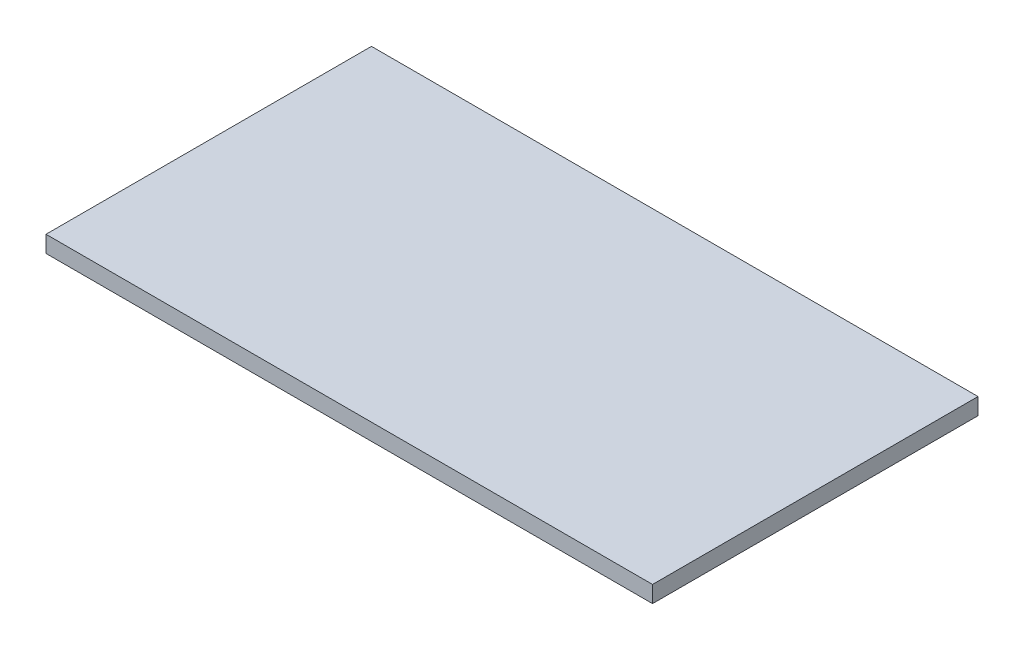
ISO-10303-21;
HEADER;
FILE_DESCRIPTION(('STEP AP214'),'2;1');
FILE_NAME('part.step','',(''),(''),'','','');
FILE_SCHEMA(('AUTOMOTIVE_DESIGN { 1 0 10303 214 1 1 1 1 }'));
ENDSEC;
DATA;
#1=APPLICATION_CONTEXT('core data for automotive mechanical design processes');
#2=APPLICATION_PROTOCOL_DEFINITION('international standard','automotive_design',2000,#1);
#3=PRODUCT_CONTEXT('',#1,'mechanical');
#4=PRODUCT('Part','Part','',(#3));
#5=PRODUCT_RELATED_PRODUCT_CATEGORY('part','',(#4));
#6=PRODUCT_DEFINITION_FORMATION('','',#4);
#7=PRODUCT_DEFINITION_CONTEXT('part definition',#1,'design');
#8=PRODUCT_DEFINITION('design','',#6,#7);
#9=PRODUCT_DEFINITION_SHAPE('','',#8);
#10=(LENGTH_UNIT() NAMED_UNIT(*) SI_UNIT(.MILLI.,.METRE.));
#11=(NAMED_UNIT(*) PLANE_ANGLE_UNIT() SI_UNIT($,.RADIAN.));
#12=(NAMED_UNIT(*) SI_UNIT($,.STERADIAN.) SOLID_ANGLE_UNIT());
#13=UNCERTAINTY_MEASURE_WITH_UNIT(LENGTH_MEASURE(1.E-05),#10,'distance_accuracy_value','');
#14=(GEOMETRIC_REPRESENTATION_CONTEXT(3) GLOBAL_UNCERTAINTY_ASSIGNED_CONTEXT((#13)) GLOBAL_UNIT_ASSIGNED_CONTEXT((#10,
#11,#12)) REPRESENTATION_CONTEXT('',''));
#15=CARTESIAN_POINT('',(0.,0.,0.));
#16=DIRECTION('',(0.,0.,1.));
#17=DIRECTION('',(1.,0.,0.));
#18=AXIS2_PLACEMENT_3D('',#15,#16,#17);
#19=CARTESIAN_POINT('',(-206.648563968668,14.2875,-106.043342036554));
#20=DIRECTION('',(1.,0.,0.));
#21=DIRECTION('',(0.,0.,-1.));
#22=AXIS2_PLACEMENT_3D('',#19,#20,#21);
#23=PLANE('',#22);
#24=DIRECTION('',(0.,0.,1.));
#25=VECTOR('',#24,1.);
#26=CARTESIAN_POINT('',(-206.648563968668,0.,-106.043342036554));
#27=LINE('',#26,#25);
#28=CARTESIAN_POINT('',(-206.648563968668,0.,-106.043342036554));
#29=VERTEX_POINT('',#28);
#30=CARTESIAN_POINT('',(-206.648563968668,0.,173.356657963446));
#31=VERTEX_POINT('',#30);
#32=EDGE_CURVE('E97',#29,#31,#27,.T.);
#33=ORIENTED_EDGE('',*,*,#32,.T.);
#34=DIRECTION('',(0.,-1.,0.));
#35=VECTOR('',#34,1.);
#36=CARTESIAN_POINT('',(-206.648563968668,14.2875,173.356657963446));
#37=LINE('',#36,#35);
#38=CARTESIAN_POINT('',(-206.648563968668,14.2875,173.356657963446));
#39=VERTEX_POINT('',#38);
#40=EDGE_CURVE('E11',#39,#31,#37,.T.);
#41=ORIENTED_EDGE('',*,*,#40,.F.);
#42=DIRECTION('',(0.,0.,1.));
#43=VECTOR('',#42,1.);
#44=CARTESIAN_POINT('',(-206.648563968668,14.2875,-106.043342036554));
#45=LINE('',#44,#43);
#46=CARTESIAN_POINT('',(-206.648563968668,14.2875,-106.043342036554));
#47=VERTEX_POINT('',#46);
#48=EDGE_CURVE('E85',#47,#39,#45,.T.);
#49=ORIENTED_EDGE('',*,*,#48,.F.);
#50=DIRECTION('',(0.,-1.,0.));
#51=VECTOR('',#50,1.);
#52=CARTESIAN_POINT('',(-206.648563968668,14.2875,-106.043342036554));
#53=LINE('',#52,#51);
#54=EDGE_CURVE('E93',#47,#29,#53,.T.);
#55=ORIENTED_EDGE('',*,*,#54,.T.);
#56=EDGE_LOOP('',(#33,#41,#49,#55));
#57=FACE_BOUND('',#56,.T.);
#58=ADVANCED_FACE('F34',(#57),#23,.F.);
#59=CARTESIAN_POINT('',(-206.648563968668,14.2875,173.356657963446));
#60=DIRECTION('',(0.,0.,-1.));
#61=DIRECTION('',(-1.,0.,0.));
#62=AXIS2_PLACEMENT_3D('',#59,#60,#61);
#63=PLANE('',#62);
#64=DIRECTION('',(1.,0.,0.));
#65=VECTOR('',#64,1.);
#66=CARTESIAN_POINT('',(-206.648563968668,0.,173.356657963446));
#67=LINE('',#66,#65);
#68=CARTESIAN_POINT('',(314.051436031332,0.,173.356657963446));
#69=VERTEX_POINT('',#68);
#70=EDGE_CURVE('E89',#31,#69,#67,.T.);
#71=ORIENTED_EDGE('',*,*,#70,.T.);
#72=DIRECTION('',(0.,-1.,0.));
#73=VECTOR('',#72,1.);
#74=CARTESIAN_POINT('',(314.051436031332,14.2875,173.356657963446));
#75=LINE('',#74,#73);
#76=CARTESIAN_POINT('',(314.051436031332,14.2875,173.356657963446));
#77=VERTEX_POINT('',#76);
#78=EDGE_CURVE('E42',#77,#69,#75,.T.);
#79=ORIENTED_EDGE('',*,*,#78,.F.);
#80=DIRECTION('',(1.,0.,0.));
#81=VECTOR('',#80,1.);
#82=CARTESIAN_POINT('',(-206.648563968668,14.2875,173.356657963446));
#83=LINE('',#82,#81);
#84=EDGE_CURVE('E80',#39,#77,#83,.T.);
#85=ORIENTED_EDGE('',*,*,#84,.F.);
#86=ORIENTED_EDGE('',*,*,#40,.T.);
#87=EDGE_LOOP('',(#71,#79,#85,#86));
#88=FACE_BOUND('',#87,.T.);
#89=ADVANCED_FACE('F88',(#88),#63,.F.);
#90=CARTESIAN_POINT('',(314.051436031332,14.2875,-106.043342036554));
#91=DIRECTION('',(-1.,0.,0.));
#92=DIRECTION('',(0.,0.,1.));
#93=AXIS2_PLACEMENT_3D('',#90,#91,#92);
#94=PLANE('',#93);
#95=DIRECTION('',(0.,0.,-1.));
#96=VECTOR('',#95,1.);
#97=CARTESIAN_POINT('',(314.051436031332,0.,-106.043342036554));
#98=LINE('',#97,#96);
#99=CARTESIAN_POINT('',(314.051436031332,0.,-106.043342036554));
#100=VERTEX_POINT('',#99);
#101=EDGE_CURVE('E67',#69,#100,#98,.T.);
#102=ORIENTED_EDGE('',*,*,#101,.T.);
#103=DIRECTION('',(0.,-1.,0.));
#104=VECTOR('',#103,1.);
#105=CARTESIAN_POINT('',(314.051436031332,14.2875,-106.043342036554));
#106=LINE('',#105,#104);
#107=CARTESIAN_POINT('',(314.051436031332,14.2875,-106.043342036554));
#108=VERTEX_POINT('',#107);
#109=EDGE_CURVE('E90',#108,#100,#106,.T.);
#110=ORIENTED_EDGE('',*,*,#109,.F.);
#111=DIRECTION('',(0.,0.,-1.));
#112=VECTOR('',#111,1.);
#113=CARTESIAN_POINT('',(314.051436031332,14.2875,-106.043342036554));
#114=LINE('',#113,#112);
#115=EDGE_CURVE('E83',#77,#108,#114,.T.);
#116=ORIENTED_EDGE('',*,*,#115,.F.);
#117=ORIENTED_EDGE('',*,*,#78,.T.);
#118=EDGE_LOOP('',(#102,#110,#116,#117));
#119=FACE_BOUND('',#118,.T.);
#120=ADVANCED_FACE('F91',(#119),#94,.F.);
#121=CARTESIAN_POINT('',(-206.648563968668,14.2875,-106.043342036554));
#122=DIRECTION('',(0.,0.,1.));
#123=DIRECTION('',(1.,0.,0.));
#124=AXIS2_PLACEMENT_3D('',#121,#122,#123);
#125=PLANE('',#124);
#126=DIRECTION('',(-1.,0.,0.));
#127=VECTOR('',#126,1.);
#128=CARTESIAN_POINT('',(-206.648563968668,0.,-106.043342036554));
#129=LINE('',#128,#127);
#130=EDGE_CURVE('E73',#100,#29,#129,.T.);
#131=ORIENTED_EDGE('',*,*,#130,.T.);
#132=ORIENTED_EDGE('',*,*,#54,.F.);
#133=DIRECTION('',(-1.,0.,0.));
#134=VECTOR('',#133,1.);
#135=CARTESIAN_POINT('',(-206.648563968668,14.2875,-106.043342036554));
#136=LINE('',#135,#134);
#137=EDGE_CURVE('E50',#108,#47,#136,.T.);
#138=ORIENTED_EDGE('',*,*,#137,.F.);
#139=ORIENTED_EDGE('',*,*,#109,.T.);
#140=EDGE_LOOP('',(#131,#132,#138,#139));
#141=FACE_BOUND('',#140,.T.);
#142=ADVANCED_FACE('F104',(#141),#125,.F.);
#143=CARTESIAN_POINT('',(0.,14.2875,0.));
#144=DIRECTION('',(0.,1.,0.));
#145=DIRECTION('',(0.,0.,1.));
#146=AXIS2_PLACEMENT_3D('',#143,#144,#145);
#147=PLANE('',#146);
#148=ORIENTED_EDGE('',*,*,#48,.T.);
#149=ORIENTED_EDGE('',*,*,#84,.T.);
#150=ORIENTED_EDGE('',*,*,#115,.T.);
#151=ORIENTED_EDGE('',*,*,#137,.T.);
#152=EDGE_LOOP('',(#148,#149,#150,#151));
#153=FACE_BOUND('',#152,.T.);
#154=ADVANCED_FACE('F81',(#153),#147,.T.);
#155=CARTESIAN_POINT('',(0.,0.,0.));
#156=DIRECTION('',(0.,1.,0.));
#157=DIRECTION('',(0.,0.,1.));
#158=AXIS2_PLACEMENT_3D('',#155,#156,#157);
#159=PLANE('',#158);
#160=ORIENTED_EDGE('',*,*,#32,.F.);
#161=ORIENTED_EDGE('',*,*,#130,.F.);
#162=ORIENTED_EDGE('',*,*,#101,.F.);
#163=ORIENTED_EDGE('',*,*,#70,.F.);
#164=EDGE_LOOP('',(#160,#161,#162,#163));
#165=FACE_BOUND('',#164,.T.);
#166=ADVANCED_FACE('F107',(#165),#159,.F.);
#167=CLOSED_SHELL('',(#58,#89,#120,#142,#154,#166));
#168=MANIFOLD_SOLID_BREP('B2',#167);
#169=ADVANCED_BREP_SHAPE_REPRESENTATION('',(#18,#168),#14);
#170=SHAPE_DEFINITION_REPRESENTATION(#9,#169);
ENDSEC;
END-ISO-10303-21;
